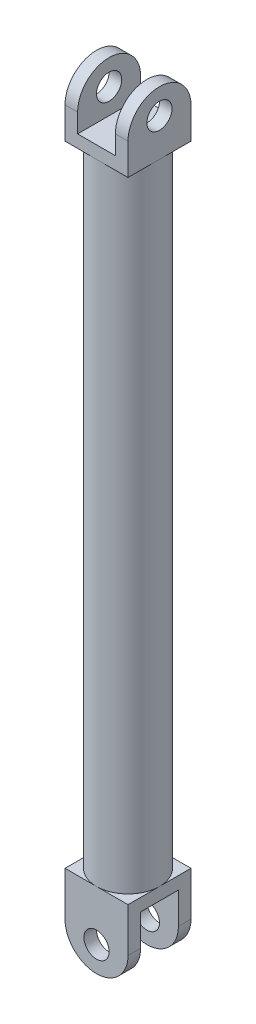
ISO-10303-21;
HEADER;
FILE_DESCRIPTION(('STEP AP214'),'2;1');
FILE_NAME('part.step','',(''),(''),'','','');
FILE_SCHEMA(('AUTOMOTIVE_DESIGN { 1 0 10303 214 1 1 1 1 }'));
ENDSEC;
DATA;
#1=APPLICATION_CONTEXT('core data for automotive mechanical design processes');
#2=APPLICATION_PROTOCOL_DEFINITION('international standard','automotive_design',2000,#1);
#3=PRODUCT_CONTEXT('',#1,'mechanical');
#4=PRODUCT('Part','Part','',(#3));
#5=PRODUCT_RELATED_PRODUCT_CATEGORY('part','',(#4));
#6=PRODUCT_DEFINITION_FORMATION('','',#4);
#7=PRODUCT_DEFINITION_CONTEXT('part definition',#1,'design');
#8=PRODUCT_DEFINITION('design','',#6,#7);
#9=PRODUCT_DEFINITION_SHAPE('','',#8);
#10=(LENGTH_UNIT() NAMED_UNIT(*) SI_UNIT(.MILLI.,.METRE.));
#11=(NAMED_UNIT(*) PLANE_ANGLE_UNIT() SI_UNIT($,.RADIAN.));
#12=(NAMED_UNIT(*) SI_UNIT($,.STERADIAN.) SOLID_ANGLE_UNIT());
#13=UNCERTAINTY_MEASURE_WITH_UNIT(LENGTH_MEASURE(1.E-05),#10,'distance_accuracy_value','');
#14=(GEOMETRIC_REPRESENTATION_CONTEXT(3) GLOBAL_UNCERTAINTY_ASSIGNED_CONTEXT((#13)) GLOBAL_UNIT_ASSIGNED_CONTEXT((#10,
#11,#12)) REPRESENTATION_CONTEXT('',''));
#15=CARTESIAN_POINT('',(0.,0.,0.));
#16=DIRECTION('',(0.,0.,1.));
#17=DIRECTION('',(1.,0.,0.));
#18=AXIS2_PLACEMENT_3D('',#15,#16,#17);
#19=CARTESIAN_POINT('',(0.,-142.5,7.5));
#20=DIRECTION('',(0.,0.,-1.));
#21=DIRECTION('',(-1.,0.,0.));
#22=AXIS2_PLACEMENT_3D('',#19,#20,#21);
#23=CYLINDRICAL_SURFACE('',#22,12.5);
#24=DIRECTION('',(0.,0.,1.));
#25=VECTOR('',#24,1.);
#26=CARTESIAN_POINT('',(-12.5,-142.5,7.5));
#27=LINE('',#26,#25);
#28=CARTESIAN_POINT('',(-12.5,-142.5,7.5));
#29=VERTEX_POINT('',#28);
#30=CARTESIAN_POINT('',(-12.5,-142.5,12.5));
#31=VERTEX_POINT('',#30);
#32=EDGE_CURVE('E374',#29,#31,#27,.T.);
#33=ORIENTED_EDGE('',*,*,#32,.F.);
#34=CARTESIAN_POINT('',(0.,-142.5,7.5));
#35=DIRECTION('',(0.,0.,1.));
#36=DIRECTION('',(1.,0.,0.));
#37=AXIS2_PLACEMENT_3D('',#34,#35,#36);
#38=CIRCLE('',#37,12.5);
#39=CARTESIAN_POINT('',(12.5,-142.5,7.5));
#40=VERTEX_POINT('',#39);
#41=EDGE_CURVE('E50',#40,#29,#38,.F.);
#42=ORIENTED_EDGE('',*,*,#41,.F.);
#43=DIRECTION('',(0.,0.,-1.));
#44=VECTOR('',#43,1.);
#45=CARTESIAN_POINT('',(12.5,-142.5,12.5));
#46=LINE('',#45,#44);
#47=CARTESIAN_POINT('',(12.5,-142.5,12.5));
#48=VERTEX_POINT('',#47);
#49=EDGE_CURVE('E377',#48,#40,#46,.T.);
#50=ORIENTED_EDGE('',*,*,#49,.F.);
#51=CARTESIAN_POINT('',(0.,-142.5,12.5));
#52=DIRECTION('',(0.,0.,1.));
#53=DIRECTION('',(1.,0.,0.));
#54=AXIS2_PLACEMENT_3D('',#51,#52,#53);
#55=CIRCLE('',#54,12.5);
#56=EDGE_CURVE('E11',#31,#48,#55,.T.);
#57=ORIENTED_EDGE('',*,*,#56,.F.);
#58=EDGE_LOOP('',(#33,#42,#50,#57));
#59=FACE_BOUND('',#58,.T.);
#60=ADVANCED_FACE('F41',(#59),#23,.T.);
#61=CARTESIAN_POINT('',(0.,-142.5,-12.5));
#62=DIRECTION('',(0.,0.,-1.));
#63=DIRECTION('',(-1.,0.,0.));
#64=AXIS2_PLACEMENT_3D('',#61,#62,#63);
#65=CYLINDRICAL_SURFACE('',#64,12.5);
#66=DIRECTION('',(0.,0.,1.));
#67=VECTOR('',#66,1.);
#68=CARTESIAN_POINT('',(-12.5,-142.5,-12.5));
#69=LINE('',#68,#67);
#70=CARTESIAN_POINT('',(-12.5,-142.5,-12.5));
#71=VERTEX_POINT('',#70);
#72=CARTESIAN_POINT('',(-12.5,-142.5,-7.5));
#73=VERTEX_POINT('',#72);
#74=EDGE_CURVE('E356',#71,#73,#69,.T.);
#75=ORIENTED_EDGE('',*,*,#74,.F.);
#76=CARTESIAN_POINT('',(0.,-142.5,-12.5));
#77=DIRECTION('',(0.,0.,1.));
#78=DIRECTION('',(1.,0.,0.));
#79=AXIS2_PLACEMENT_3D('',#76,#77,#78);
#80=CIRCLE('',#79,12.5);
#81=CARTESIAN_POINT('',(12.5,-142.5,-12.5));
#82=VERTEX_POINT('',#81);
#83=EDGE_CURVE('E368',#82,#71,#80,.F.);
#84=ORIENTED_EDGE('',*,*,#83,.F.);
#85=DIRECTION('',(0.,0.,-1.));
#86=VECTOR('',#85,1.);
#87=CARTESIAN_POINT('',(12.5,-142.5,12.5));
#88=LINE('',#87,#86);
#89=CARTESIAN_POINT('',(12.5,-142.5,-7.5));
#90=VERTEX_POINT('',#89);
#91=EDGE_CURVE('E364',#90,#82,#88,.T.);
#92=ORIENTED_EDGE('',*,*,#91,.F.);
#93=CARTESIAN_POINT('',(0.,-142.5,-7.5));
#94=DIRECTION('',(0.,0.,-1.));
#95=DIRECTION('',(-1.,0.,0.));
#96=AXIS2_PLACEMENT_3D('',#93,#94,#95);
#97=CIRCLE('',#96,12.5);
#98=EDGE_CURVE('E371',#73,#90,#97,.F.);
#99=ORIENTED_EDGE('',*,*,#98,.F.);
#100=EDGE_LOOP('',(#75,#84,#92,#99));
#101=FACE_BOUND('',#100,.T.);
#102=ADVANCED_FACE('F466',(#101),#65,.T.);
#103=CARTESIAN_POINT('',(0.,-130.,0.));
#104=DIRECTION('',(0.,1.,0.));
#105=DIRECTION('',(0.,0.,1.));
#106=AXIS2_PLACEMENT_3D('',#103,#104,#105);
#107=PLANE('',#106);
#108=DIRECTION('',(1.,0.,0.));
#109=VECTOR('',#108,1.);
#110=CARTESIAN_POINT('',(-12.5,-130.,7.5));
#111=LINE('',#110,#109);
#112=CARTESIAN_POINT('',(-12.5,-130.,7.5));
#113=VERTEX_POINT('',#112);
#114=CARTESIAN_POINT('',(12.5,-130.,7.5));
#115=VERTEX_POINT('',#114);
#116=EDGE_CURVE('E180',#113,#115,#111,.T.);
#117=ORIENTED_EDGE('',*,*,#116,.F.);
#118=DIRECTION('',(0.,0.,-1.));
#119=VECTOR('',#118,1.);
#120=CARTESIAN_POINT('',(-12.5,-130.,12.5));
#121=LINE('',#120,#119);
#122=CARTESIAN_POINT('',(-12.5,-130.,-7.5));
#123=VERTEX_POINT('',#122);
#124=EDGE_CURVE('E193',#113,#123,#121,.T.);
#125=ORIENTED_EDGE('',*,*,#124,.T.);
#126=DIRECTION('',(-1.,0.,0.));
#127=VECTOR('',#126,1.);
#128=CARTESIAN_POINT('',(-12.5,-130.,-7.5));
#129=LINE('',#128,#127);
#130=CARTESIAN_POINT('',(12.5,-130.,-7.49999999999999));
#131=VERTEX_POINT('',#130);
#132=EDGE_CURVE('E186',#131,#123,#129,.T.);
#133=ORIENTED_EDGE('',*,*,#132,.F.);
#134=DIRECTION('',(0.,0.,-1.));
#135=VECTOR('',#134,1.);
#136=CARTESIAN_POINT('',(12.5,-130.,12.5));
#137=LINE('',#136,#135);
#138=EDGE_CURVE('E196',#115,#131,#137,.T.);
#139=ORIENTED_EDGE('',*,*,#138,.F.);
#140=EDGE_LOOP('',(#117,#125,#133,#139));
#141=FACE_BOUND('',#140,.T.);
#142=ADVANCED_FACE('F191',(#141),#107,.F.);
#143=CARTESIAN_POINT('',(12.5,137.5,0.));
#144=DIRECTION('',(1.,0.,0.));
#145=DIRECTION('',(0.,0.,-1.));
#146=AXIS2_PLACEMENT_3D('',#143,#144,#145);
#147=CYLINDRICAL_SURFACE('',#146,12.5);
#148=DIRECTION('',(-1.,0.,0.));
#149=VECTOR('',#148,1.);
#150=CARTESIAN_POINT('',(12.5,137.5,12.5));
#151=LINE('',#150,#149);
#152=CARTESIAN_POINT('',(12.5,137.5,12.5));
#153=VERTEX_POINT('',#152);
#154=CARTESIAN_POINT('',(7.50000000000001,137.5,12.5));
#155=VERTEX_POINT('',#154);
#156=EDGE_CURVE('E342',#153,#155,#151,.T.);
#157=ORIENTED_EDGE('',*,*,#156,.F.);
#158=CARTESIAN_POINT('',(12.5,137.5,0.));
#159=DIRECTION('',(-1.,0.,0.));
#160=DIRECTION('',(0.,0.,1.));
#161=AXIS2_PLACEMENT_3D('',#158,#159,#160);
#162=CIRCLE('',#161,12.5);
#163=CARTESIAN_POINT('',(12.5,137.5,-12.5));
#164=VERTEX_POINT('',#163);
#165=EDGE_CURVE('E350',#164,#153,#162,.F.);
#166=ORIENTED_EDGE('',*,*,#165,.F.);
#167=DIRECTION('',(-1.,0.,0.));
#168=VECTOR('',#167,1.);
#169=CARTESIAN_POINT('',(12.5,137.5,-12.5));
#170=LINE('',#169,#168);
#171=CARTESIAN_POINT('',(7.50000000000001,137.5,-12.5));
#172=VERTEX_POINT('',#171);
#173=EDGE_CURVE('E346',#172,#164,#170,.F.);
#174=ORIENTED_EDGE('',*,*,#173,.F.);
#175=CARTESIAN_POINT('',(7.50000000000001,137.5,0.));
#176=DIRECTION('',(1.,0.,0.));
#177=DIRECTION('',(0.,0.,-1.));
#178=AXIS2_PLACEMENT_3D('',#175,#176,#177);
#179=CIRCLE('',#178,12.5);
#180=EDGE_CURVE('E353',#155,#172,#179,.F.);
#181=ORIENTED_EDGE('',*,*,#180,.F.);
#182=EDGE_LOOP('',(#157,#166,#174,#181));
#183=FACE_BOUND('',#182,.T.);
#184=ADVANCED_FACE('F446',(#183),#147,.T.);
#185=CARTESIAN_POINT('',(-7.5,137.5,0.));
#186=DIRECTION('',(1.,0.,0.));
#187=DIRECTION('',(0.,0.,-1.));
#188=AXIS2_PLACEMENT_3D('',#185,#186,#187);
#189=CYLINDRICAL_SURFACE('',#188,12.5);
#190=DIRECTION('',(-1.,0.,0.));
#191=VECTOR('',#190,1.);
#192=CARTESIAN_POINT('',(-7.5,137.5,12.5));
#193=LINE('',#192,#191);
#194=CARTESIAN_POINT('',(-7.5,137.5,12.5));
#195=VERTEX_POINT('',#194);
#196=CARTESIAN_POINT('',(-12.5,137.5,12.5));
#197=VERTEX_POINT('',#196);
#198=EDGE_CURVE('E325',#195,#197,#193,.T.);
#199=ORIENTED_EDGE('',*,*,#198,.F.);
#200=CARTESIAN_POINT('',(-7.5,137.5,0.));
#201=DIRECTION('',(-1.,0.,0.));
#202=DIRECTION('',(0.,0.,1.));
#203=AXIS2_PLACEMENT_3D('',#200,#201,#202);
#204=CIRCLE('',#203,12.5);
#205=CARTESIAN_POINT('',(-7.5,137.5,-12.5));
#206=VERTEX_POINT('',#205);
#207=EDGE_CURVE('E336',#206,#195,#204,.F.);
#208=ORIENTED_EDGE('',*,*,#207,.F.);
#209=DIRECTION('',(-1.,0.,0.));
#210=VECTOR('',#209,1.);
#211=CARTESIAN_POINT('',(-7.5,137.5,-12.5));
#212=LINE('',#211,#210);
#213=CARTESIAN_POINT('',(-12.5,137.5,-12.5));
#214=VERTEX_POINT('',#213);
#215=EDGE_CURVE('E332',#214,#206,#212,.F.);
#216=ORIENTED_EDGE('',*,*,#215,.F.);
#217=CARTESIAN_POINT('',(-12.5,137.5,0.));
#218=DIRECTION('',(1.,0.,0.));
#219=DIRECTION('',(0.,0.,-1.));
#220=AXIS2_PLACEMENT_3D('',#217,#218,#219);
#221=CIRCLE('',#220,12.5);
#222=EDGE_CURVE('E339',#197,#214,#221,.F.);
#223=ORIENTED_EDGE('',*,*,#222,.F.);
#224=EDGE_LOOP('',(#199,#208,#216,#223));
#225=FACE_BOUND('',#224,.T.);
#226=ADVANCED_FACE('F563',(#225),#189,.T.);
#227=CARTESIAN_POINT('',(0.,130.,0.));
#228=DIRECTION('',(0.,1.,0.));
#229=DIRECTION('',(0.,0.,1.));
#230=AXIS2_PLACEMENT_3D('',#227,#228,#229);
#231=PLANE('',#230);
#232=DIRECTION('',(1.,0.,0.));
#233=VECTOR('',#232,1.);
#234=CARTESIAN_POINT('',(-12.5,130.,12.5));
#235=LINE('',#234,#233);
#236=CARTESIAN_POINT('',(-7.5,130.,12.5));
#237=VERTEX_POINT('',#236);
#238=CARTESIAN_POINT('',(7.50000000000001,130.,12.5));
#239=VERTEX_POINT('',#238);
#240=EDGE_CURVE('E275',#237,#239,#235,.T.);
#241=ORIENTED_EDGE('',*,*,#240,.T.);
#242=DIRECTION('',(0.,0.,-1.));
#243=VECTOR('',#242,1.);
#244=CARTESIAN_POINT('',(7.50000000000001,130.,0.));
#245=LINE('',#244,#243);
#246=CARTESIAN_POINT('',(7.50000000000001,130.,-12.5));
#247=VERTEX_POINT('',#246);
#248=EDGE_CURVE('E260',#239,#247,#245,.T.);
#249=ORIENTED_EDGE('',*,*,#248,.T.);
#250=DIRECTION('',(-1.,0.,0.));
#251=VECTOR('',#250,1.);
#252=CARTESIAN_POINT('',(-12.5,130.,-12.5));
#253=LINE('',#252,#251);
#254=CARTESIAN_POINT('',(-7.5,130.,-12.5));
#255=VERTEX_POINT('',#254);
#256=EDGE_CURVE('E271',#247,#255,#253,.T.);
#257=ORIENTED_EDGE('',*,*,#256,.T.);
#258=DIRECTION('',(0.,0.,1.));
#259=VECTOR('',#258,1.);
#260=CARTESIAN_POINT('',(-7.5,130.,0.));
#261=LINE('',#260,#259);
#262=EDGE_CURVE('E314',#255,#237,#261,.T.);
#263=ORIENTED_EDGE('',*,*,#262,.T.);
#264=EDGE_LOOP('',(#241,#249,#257,#263));
#265=FACE_BOUND('',#264,.T.);
#266=ADVANCED_FACE('F438',(#265),#231,.T.);
#267=CARTESIAN_POINT('',(0.,125.,0.));
#268=DIRECTION('',(0.,-1.,0.));
#269=DIRECTION('',(0.,0.,-1.));
#270=AXIS2_PLACEMENT_3D('',#267,#268,#269);
#271=CYLINDRICAL_SURFACE('',#270,12.5);
#272=CARTESIAN_POINT('',(0.,125.,0.));
#273=DIRECTION('',(0.,1.,0.));
#274=DIRECTION('',(0.,0.,1.));
#275=AXIS2_PLACEMENT_3D('',#272,#273,#274);
#276=CIRCLE('',#275,12.5);
#277=CARTESIAN_POINT('',(0.,125.,12.5));
#278=VERTEX_POINT('',#277);
#279=CARTESIAN_POINT('',(12.5,125.,0.));
#280=VERTEX_POINT('',#279);
#281=EDGE_CURVE('E311',#278,#280,#276,.T.);
#282=ORIENTED_EDGE('',*,*,#281,.F.);
#283=CARTESIAN_POINT('',(-12.5,125.,0.));
#284=VERTEX_POINT('',#283);
#285=EDGE_CURVE('E316',#284,#278,#276,.T.);
#286=ORIENTED_EDGE('',*,*,#285,.F.);
#287=CARTESIAN_POINT('',(0.,125.,-12.5));
#288=VERTEX_POINT('',#287);
#289=EDGE_CURVE('E382',#288,#284,#276,.T.);
#290=ORIENTED_EDGE('',*,*,#289,.F.);
#291=EDGE_CURVE('E315',#280,#288,#276,.T.);
#292=ORIENTED_EDGE('',*,*,#291,.F.);
#293=EDGE_LOOP('',(#282,#286,#290,#292));
#294=FACE_BOUND('',#293,.T.);
#295=CARTESIAN_POINT('',(0.,-125.,0.));
#296=DIRECTION('',(0.,1.,0.));
#297=DIRECTION('',(0.,0.,1.));
#298=AXIS2_PLACEMENT_3D('',#295,#296,#297);
#299=CIRCLE('',#298,12.5);
#300=CARTESIAN_POINT('',(0.,-125.,12.5));
#301=VERTEX_POINT('',#300);
#302=CARTESIAN_POINT('',(12.5,-125.,0.));
#303=VERTEX_POINT('',#302);
#304=EDGE_CURVE('E317',#301,#303,#299,.T.);
#305=ORIENTED_EDGE('',*,*,#304,.T.);
#306=CARTESIAN_POINT('',(0.,-125.,-12.5));
#307=VERTEX_POINT('',#306);
#308=EDGE_CURVE('E321',#303,#307,#299,.T.);
#309=ORIENTED_EDGE('',*,*,#308,.T.);
#310=CARTESIAN_POINT('',(-12.5,-125.,0.));
#311=VERTEX_POINT('',#310);
#312=EDGE_CURVE('E387',#307,#311,#299,.T.);
#313=ORIENTED_EDGE('',*,*,#312,.T.);
#314=EDGE_CURVE('E310',#311,#301,#299,.T.);
#315=ORIENTED_EDGE('',*,*,#314,.T.);
#316=EDGE_LOOP('',(#305,#309,#313,#315));
#317=FACE_BOUND('',#316,.T.);
#318=ADVANCED_FACE('F418',(#294,#317),#271,.T.);
#319=CARTESIAN_POINT('',(0.,125.,0.));
#320=DIRECTION('',(0.,1.,0.));
#321=DIRECTION('',(0.,0.,1.));
#322=AXIS2_PLACEMENT_3D('',#319,#320,#321);
#323=PLANE('',#322);
#324=DIRECTION('',(0.,0.,-1.));
#325=VECTOR('',#324,1.);
#326=CARTESIAN_POINT('',(12.5,125.,-12.5));
#327=LINE('',#326,#325);
#328=CARTESIAN_POINT('',(12.5,125.,12.5));
#329=VERTEX_POINT('',#328);
#330=EDGE_CURVE('E281',#329,#280,#327,.T.);
#331=ORIENTED_EDGE('',*,*,#330,.F.);
#332=DIRECTION('',(1.,0.,0.));
#333=VECTOR('',#332,1.);
#334=CARTESIAN_POINT('',(-12.5,125.,12.5));
#335=LINE('',#334,#333);
#336=EDGE_CURVE('E295',#278,#329,#335,.T.);
#337=ORIENTED_EDGE('',*,*,#336,.F.);
#338=ORIENTED_EDGE('',*,*,#281,.T.);
#339=EDGE_LOOP('',(#331,#337,#338));
#340=FACE_BOUND('',#339,.T.);
#341=ADVANCED_FACE('F452',(#340),#323,.F.);
#342=ORIENTED_EDGE('',*,*,#291,.T.);
#343=DIRECTION('',(-1.,0.,0.));
#344=VECTOR('',#343,1.);
#345=CARTESIAN_POINT('',(-12.5,125.,-12.5));
#346=LINE('',#345,#344);
#347=CARTESIAN_POINT('',(12.5,125.,-12.5));
#348=VERTEX_POINT('',#347);
#349=EDGE_CURVE('E286',#348,#288,#346,.T.);
#350=ORIENTED_EDGE('',*,*,#349,.F.);
#351=EDGE_CURVE('E270',#280,#348,#327,.T.);
#352=ORIENTED_EDGE('',*,*,#351,.F.);
#353=EDGE_LOOP('',(#342,#350,#352));
#354=FACE_BOUND('',#353,.T.);
#355=ADVANCED_FACE('F406',(#354),#323,.F.);
#356=DIRECTION('',(0.,0.,1.));
#357=VECTOR('',#356,1.);
#358=CARTESIAN_POINT('',(-12.5,125.,-12.5));
#359=LINE('',#358,#357);
#360=CARTESIAN_POINT('',(-12.5,125.,-12.5));
#361=VERTEX_POINT('',#360);
#362=EDGE_CURVE('E291',#361,#284,#359,.T.);
#363=ORIENTED_EDGE('',*,*,#362,.F.);
#364=EDGE_CURVE('E285',#288,#361,#346,.T.);
#365=ORIENTED_EDGE('',*,*,#364,.F.);
#366=ORIENTED_EDGE('',*,*,#289,.T.);
#367=EDGE_LOOP('',(#363,#365,#366));
#368=FACE_BOUND('',#367,.T.);
#369=ADVANCED_FACE('F422',(#368),#323,.F.);
#370=ORIENTED_EDGE('',*,*,#285,.T.);
#371=CARTESIAN_POINT('',(-12.5,125.,12.5));
#372=VERTEX_POINT('',#371);
#373=EDGE_CURVE('E276',#372,#278,#335,.T.);
#374=ORIENTED_EDGE('',*,*,#373,.F.);
#375=EDGE_CURVE('E290',#284,#372,#359,.T.);
#376=ORIENTED_EDGE('',*,*,#375,.F.);
#377=EDGE_LOOP('',(#370,#374,#376));
#378=FACE_BOUND('',#377,.T.);
#379=ADVANCED_FACE('F455',(#378),#323,.F.);
#380=CARTESIAN_POINT('',(12.5,130.,-12.5));
#381=DIRECTION('',(-1.,0.,0.));
#382=DIRECTION('',(0.,0.,1.));
#383=AXIS2_PLACEMENT_3D('',#380,#381,#382);
#384=PLANE('',#383);
#385=CARTESIAN_POINT('',(12.5,140.,0.));
#386=DIRECTION('',(-1.,0.,0.));
#387=DIRECTION('',(0.,0.,1.));
#388=AXIS2_PLACEMENT_3D('',#385,#386,#387);
#389=CIRCLE('',#388,5.00000000000001);
#390=CARTESIAN_POINT('',(12.5,140.,5.));
#391=VERTEX_POINT('',#390);
#392=EDGE_CURVE('E236',#391,#391,#389,.T.);
#393=ORIENTED_EDGE('',*,*,#392,.T.);
#394=EDGE_LOOP('',(#393));
#395=FACE_BOUND('',#394,.T.);
#396=DIRECTION('',(0.,-1.,0.));
#397=VECTOR('',#396,1.);
#398=CARTESIAN_POINT('',(12.5,130.,-12.5));
#399=LINE('',#398,#397);
#400=EDGE_CURVE('E307',#164,#348,#399,.T.);
#401=ORIENTED_EDGE('',*,*,#400,.F.);
#402=ORIENTED_EDGE('',*,*,#165,.T.);
#403=DIRECTION('',(0.,-1.,0.));
#404=VECTOR('',#403,1.);
#405=CARTESIAN_POINT('',(12.5,130.,12.5));
#406=LINE('',#405,#404);
#407=EDGE_CURVE('E280',#153,#329,#406,.T.);
#408=ORIENTED_EDGE('',*,*,#407,.T.);
#409=ORIENTED_EDGE('',*,*,#330,.T.);
#410=ORIENTED_EDGE('',*,*,#351,.T.);
#411=EDGE_LOOP('',(#401,#402,#408,#409,#410));
#412=FACE_BOUND('',#411,.T.);
#413=ADVANCED_FACE('F403',(#395,#412),#384,.F.);
#414=CARTESIAN_POINT('',(-12.5,130.,-12.5));
#415=DIRECTION('',(0.,0.,1.));
#416=DIRECTION('',(1.,0.,0.));
#417=AXIS2_PLACEMENT_3D('',#414,#415,#416);
#418=PLANE('',#417);
#419=DIRECTION('',(0.,-1.,0.));
#420=VECTOR('',#419,1.);
#421=CARTESIAN_POINT('',(7.50000000000001,150.,-12.5));
#422=LINE('',#421,#420);
#423=EDGE_CURVE('E257',#172,#247,#422,.T.);
#424=ORIENTED_EDGE('',*,*,#423,.F.);
#425=ORIENTED_EDGE('',*,*,#173,.T.);
#426=ORIENTED_EDGE('',*,*,#400,.T.);
#427=ORIENTED_EDGE('',*,*,#349,.T.);
#428=ORIENTED_EDGE('',*,*,#364,.T.);
#429=DIRECTION('',(0.,-1.,0.));
#430=VECTOR('',#429,1.);
#431=CARTESIAN_POINT('',(-12.5,130.,-12.5));
#432=LINE('',#431,#430);
#433=EDGE_CURVE('E304',#214,#361,#432,.T.);
#434=ORIENTED_EDGE('',*,*,#433,.F.);
#435=ORIENTED_EDGE('',*,*,#215,.T.);
#436=DIRECTION('',(0.,-1.,0.));
#437=VECTOR('',#436,1.);
#438=CARTESIAN_POINT('',(-7.5,150.,-12.5));
#439=LINE('',#438,#437);
#440=EDGE_CURVE('E267',#206,#255,#439,.T.);
#441=ORIENTED_EDGE('',*,*,#440,.T.);
#442=ORIENTED_EDGE('',*,*,#256,.F.);
#443=EDGE_LOOP('',(#424,#425,#426,#427,#428,#434,#435,#441,#442));
#444=FACE_BOUND('',#443,.T.);
#445=ADVANCED_FACE('F411',(#444),#418,.F.);
#446=CARTESIAN_POINT('',(-12.5,130.,-12.5));
#447=DIRECTION('',(1.,0.,0.));
#448=DIRECTION('',(0.,0.,-1.));
#449=AXIS2_PLACEMENT_3D('',#446,#447,#448);
#450=PLANE('',#449);
#451=CARTESIAN_POINT('',(-12.5,140.,0.));
#452=DIRECTION('',(1.,0.,0.));
#453=DIRECTION('',(0.,0.,-1.));
#454=AXIS2_PLACEMENT_3D('',#451,#452,#453);
#455=CIRCLE('',#454,5.00000000000001);
#456=CARTESIAN_POINT('',(-12.5,140.,-5.));
#457=VERTEX_POINT('',#456);
#458=EDGE_CURVE('E250',#457,#457,#455,.T.);
#459=ORIENTED_EDGE('',*,*,#458,.T.);
#460=EDGE_LOOP('',(#459));
#461=FACE_BOUND('',#460,.T.);
#462=DIRECTION('',(0.,-1.,0.));
#463=VECTOR('',#462,1.);
#464=CARTESIAN_POINT('',(-12.5,130.,12.5));
#465=LINE('',#464,#463);
#466=EDGE_CURVE('E301',#197,#372,#465,.T.);
#467=ORIENTED_EDGE('',*,*,#466,.F.);
#468=ORIENTED_EDGE('',*,*,#222,.T.);
#469=ORIENTED_EDGE('',*,*,#433,.T.);
#470=ORIENTED_EDGE('',*,*,#362,.T.);
#471=ORIENTED_EDGE('',*,*,#375,.T.);
#472=EDGE_LOOP('',(#467,#468,#469,#470,#471));
#473=FACE_BOUND('',#472,.T.);
#474=ADVANCED_FACE('F425',(#461,#473),#450,.F.);
#475=CARTESIAN_POINT('',(-12.5,130.,12.5));
#476=DIRECTION('',(0.,0.,-1.));
#477=DIRECTION('',(-1.,0.,0.));
#478=AXIS2_PLACEMENT_3D('',#475,#476,#477);
#479=PLANE('',#478);
#480=ORIENTED_EDGE('',*,*,#407,.F.);
#481=ORIENTED_EDGE('',*,*,#156,.T.);
#482=DIRECTION('',(0.,-1.,0.));
#483=VECTOR('',#482,1.);
#484=CARTESIAN_POINT('',(7.50000000000001,150.,12.5));
#485=LINE('',#484,#483);
#486=EDGE_CURVE('E254',#155,#239,#485,.T.);
#487=ORIENTED_EDGE('',*,*,#486,.T.);
#488=ORIENTED_EDGE('',*,*,#240,.F.);
#489=DIRECTION('',(0.,-1.,0.));
#490=VECTOR('',#489,1.);
#491=CARTESIAN_POINT('',(-7.5,150.,12.5));
#492=LINE('',#491,#490);
#493=EDGE_CURVE('E264',#195,#237,#492,.T.);
#494=ORIENTED_EDGE('',*,*,#493,.F.);
#495=ORIENTED_EDGE('',*,*,#198,.T.);
#496=ORIENTED_EDGE('',*,*,#466,.T.);
#497=ORIENTED_EDGE('',*,*,#373,.T.);
#498=ORIENTED_EDGE('',*,*,#336,.T.);
#499=EDGE_LOOP('',(#480,#481,#487,#488,#494,#495,#496,#497,#498));
#500=FACE_BOUND('',#499,.T.);
#501=ADVANCED_FACE('F450',(#500),#479,.F.);
#502=CARTESIAN_POINT('',(-7.5,150.,-12.5));
#503=DIRECTION('',(-1.,0.,0.));
#504=DIRECTION('',(0.,0.,1.));
#505=AXIS2_PLACEMENT_3D('',#502,#503,#504);
#506=PLANE('',#505);
#507=CARTESIAN_POINT('',(-7.5,140.,0.));
#508=DIRECTION('',(-1.,0.,0.));
#509=DIRECTION('',(0.,0.,1.));
#510=AXIS2_PLACEMENT_3D('',#507,#508,#509);
#511=CIRCLE('',#510,5.00000000000001);
#512=CARTESIAN_POINT('',(-7.5,140.,5.00000000000001));
#513=VERTEX_POINT('',#512);
#514=EDGE_CURVE('E246',#513,#513,#511,.T.);
#515=ORIENTED_EDGE('',*,*,#514,.T.);
#516=EDGE_LOOP('',(#515));
#517=FACE_BOUND('',#516,.T.);
#518=ORIENTED_EDGE('',*,*,#440,.F.);
#519=ORIENTED_EDGE('',*,*,#207,.T.);
#520=ORIENTED_EDGE('',*,*,#493,.T.);
#521=ORIENTED_EDGE('',*,*,#262,.F.);
#522=EDGE_LOOP('',(#518,#519,#520,#521));
#523=FACE_BOUND('',#522,.T.);
#524=ADVANCED_FACE('F433',(#517,#523),#506,.F.);
#525=CARTESIAN_POINT('',(7.50000000000001,150.,-12.5));
#526=DIRECTION('',(1.,0.,0.));
#527=DIRECTION('',(0.,0.,-1.));
#528=AXIS2_PLACEMENT_3D('',#525,#526,#527);
#529=PLANE('',#528);
#530=CARTESIAN_POINT('',(7.50000000000001,140.,0.));
#531=DIRECTION('',(1.,0.,0.));
#532=DIRECTION('',(0.,0.,-1.));
#533=AXIS2_PLACEMENT_3D('',#530,#531,#532);
#534=CIRCLE('',#533,5.00000000000001);
#535=CARTESIAN_POINT('',(7.50000000000001,140.,-5.00000000000001));
#536=VERTEX_POINT('',#535);
#537=EDGE_CURVE('E245',#536,#536,#534,.T.);
#538=ORIENTED_EDGE('',*,*,#537,.T.);
#539=EDGE_LOOP('',(#538));
#540=FACE_BOUND('',#539,.T.);
#541=ORIENTED_EDGE('',*,*,#486,.F.);
#542=ORIENTED_EDGE('',*,*,#180,.T.);
#543=ORIENTED_EDGE('',*,*,#423,.T.);
#544=ORIENTED_EDGE('',*,*,#248,.F.);
#545=EDGE_LOOP('',(#541,#542,#543,#544));
#546=FACE_BOUND('',#545,.T.);
#547=ADVANCED_FACE('F443',(#540,#546),#529,.F.);
#548=CARTESIAN_POINT('',(12.5,140.,0.));
#549=DIRECTION('',(-1.,0.,0.));
#550=DIRECTION('',(0.,0.,1.));
#551=AXIS2_PLACEMENT_3D('',#548,#549,#550);
#552=CYLINDRICAL_SURFACE('',#551,5.00000000000001);
#553=ORIENTED_EDGE('',*,*,#392,.F.);
#554=EDGE_LOOP('',(#553));
#555=FACE_BOUND('',#554,.T.);
#556=ORIENTED_EDGE('',*,*,#537,.F.);
#557=EDGE_LOOP('',(#556));
#558=FACE_BOUND('',#557,.T.);
#559=ADVANCED_FACE('F555',(#555,#558),#552,.F.);
#560=ORIENTED_EDGE('',*,*,#514,.F.);
#561=EDGE_LOOP('',(#560));
#562=FACE_BOUND('',#561,.T.);
#563=ORIENTED_EDGE('',*,*,#458,.F.);
#564=EDGE_LOOP('',(#563));
#565=FACE_BOUND('',#564,.T.);
#566=ADVANCED_FACE('F541',(#562,#565),#552,.F.);
#567=CARTESIAN_POINT('',(0.,-125.,0.));
#568=DIRECTION('',(0.,1.,0.));
#569=DIRECTION('',(0.,0.,1.));
#570=AXIS2_PLACEMENT_3D('',#567,#568,#569);
#571=PLANE('',#570);
#572=ORIENTED_EDGE('',*,*,#304,.F.);
#573=DIRECTION('',(1.,0.,0.));
#574=VECTOR('',#573,1.);
#575=CARTESIAN_POINT('',(-12.5,-125.,12.5));
#576=LINE('',#575,#574);
#577=CARTESIAN_POINT('',(12.5,-125.,12.5));
#578=VERTEX_POINT('',#577);
#579=EDGE_CURVE('E219',#301,#578,#576,.T.);
#580=ORIENTED_EDGE('',*,*,#579,.T.);
#581=DIRECTION('',(0.,0.,-1.));
#582=VECTOR('',#581,1.);
#583=CARTESIAN_POINT('',(12.5,-125.,12.5));
#584=LINE('',#583,#582);
#585=EDGE_CURVE('E220',#578,#303,#584,.T.);
#586=ORIENTED_EDGE('',*,*,#585,.T.);
#587=EDGE_LOOP('',(#572,#580,#586));
#588=FACE_BOUND('',#587,.T.);
#589=ADVANCED_FACE('F538',(#588),#571,.T.);
#590=ORIENTED_EDGE('',*,*,#308,.F.);
#591=CARTESIAN_POINT('',(12.5,-125.,-12.5));
#592=VERTEX_POINT('',#591);
#593=EDGE_CURVE('E218',#303,#592,#584,.T.);
#594=ORIENTED_EDGE('',*,*,#593,.T.);
#595=DIRECTION('',(1.,0.,0.));
#596=VECTOR('',#595,1.);
#597=CARTESIAN_POINT('',(-12.5,-125.,-12.5));
#598=LINE('',#597,#596);
#599=EDGE_CURVE('E224',#307,#592,#598,.T.);
#600=ORIENTED_EDGE('',*,*,#599,.F.);
#601=EDGE_LOOP('',(#590,#594,#600));
#602=FACE_BOUND('',#601,.T.);
#603=ADVANCED_FACE('F489',(#602),#571,.T.);
#604=ORIENTED_EDGE('',*,*,#312,.F.);
#605=CARTESIAN_POINT('',(-12.5,-125.,-12.5));
#606=VERTEX_POINT('',#605);
#607=EDGE_CURVE('E225',#606,#307,#598,.T.);
#608=ORIENTED_EDGE('',*,*,#607,.F.);
#609=DIRECTION('',(0.,0.,-1.));
#610=VECTOR('',#609,1.);
#611=CARTESIAN_POINT('',(-12.5,-125.,12.5));
#612=LINE('',#611,#610);
#613=EDGE_CURVE('E229',#311,#606,#612,.T.);
#614=ORIENTED_EDGE('',*,*,#613,.F.);
#615=EDGE_LOOP('',(#604,#608,#614));
#616=FACE_BOUND('',#615,.T.);
#617=ADVANCED_FACE('F485',(#616),#571,.T.);
#618=ORIENTED_EDGE('',*,*,#314,.F.);
#619=CARTESIAN_POINT('',(-12.5,-125.,12.5));
#620=VERTEX_POINT('',#619);
#621=EDGE_CURVE('E211',#620,#311,#612,.T.);
#622=ORIENTED_EDGE('',*,*,#621,.F.);
#623=EDGE_CURVE('E215',#620,#301,#576,.T.);
#624=ORIENTED_EDGE('',*,*,#623,.T.);
#625=EDGE_LOOP('',(#618,#622,#624));
#626=FACE_BOUND('',#625,.T.);
#627=ADVANCED_FACE('F478',(#626),#571,.T.);
#628=CARTESIAN_POINT('',(-12.5,-130.,12.5));
#629=DIRECTION('',(0.,0.,1.));
#630=DIRECTION('',(1.,0.,0.));
#631=AXIS2_PLACEMENT_3D('',#628,#629,#630);
#632=PLANE('',#631);
#633=CARTESIAN_POINT('',(0.,-145.,12.5));
#634=DIRECTION('',(0.,0.,-1.));
#635=DIRECTION('',(-1.,0.,0.));
#636=AXIS2_PLACEMENT_3D('',#633,#634,#635);
#637=CIRCLE('',#636,5.00000000000001);
#638=CARTESIAN_POINT('',(-5.00000000000001,-145.,12.5));
#639=VERTEX_POINT('',#638);
#640=EDGE_CURVE('E361',#639,#639,#637,.T.);
#641=ORIENTED_EDGE('',*,*,#640,.T.);
#642=EDGE_LOOP('',(#641));
#643=FACE_BOUND('',#642,.T.);
#644=DIRECTION('',(0.,1.,0.));
#645=VECTOR('',#644,1.);
#646=CARTESIAN_POINT('',(-12.5,-130.,12.5));
#647=LINE('',#646,#645);
#648=EDGE_CURVE('E233',#31,#620,#647,.T.);
#649=ORIENTED_EDGE('',*,*,#648,.F.);
#650=ORIENTED_EDGE('',*,*,#56,.T.);
#651=DIRECTION('',(0.,1.,0.));
#652=VECTOR('',#651,1.);
#653=CARTESIAN_POINT('',(12.5,-130.,12.5));
#654=LINE('',#653,#652);
#655=EDGE_CURVE('E205',#48,#578,#654,.T.);
#656=ORIENTED_EDGE('',*,*,#655,.T.);
#657=ORIENTED_EDGE('',*,*,#579,.F.);
#658=ORIENTED_EDGE('',*,*,#623,.F.);
#659=EDGE_LOOP('',(#649,#650,#656,#657,#658));
#660=FACE_BOUND('',#659,.T.);
#661=ADVANCED_FACE('F473',(#643,#660),#632,.T.);
#662=CARTESIAN_POINT('',(-12.5,-130.,12.5));
#663=DIRECTION('',(1.,0.,0.));
#664=DIRECTION('',(0.,0.,-1.));
#665=AXIS2_PLACEMENT_3D('',#662,#663,#664);
#666=PLANE('',#665);
#667=DIRECTION('',(0.,1.,0.));
#668=VECTOR('',#667,1.);
#669=CARTESIAN_POINT('',(-12.5,-155.,7.5));
#670=LINE('',#669,#668);
#671=EDGE_CURVE('E176',#29,#113,#670,.T.);
#672=ORIENTED_EDGE('',*,*,#671,.F.);
#673=ORIENTED_EDGE('',*,*,#32,.T.);
#674=ORIENTED_EDGE('',*,*,#648,.T.);
#675=ORIENTED_EDGE('',*,*,#621,.T.);
#676=ORIENTED_EDGE('',*,*,#613,.T.);
#677=DIRECTION('',(0.,1.,0.));
#678=VECTOR('',#677,1.);
#679=CARTESIAN_POINT('',(-12.5,-130.,-12.5));
#680=LINE('',#679,#678);
#681=EDGE_CURVE('E237',#71,#606,#680,.T.);
#682=ORIENTED_EDGE('',*,*,#681,.F.);
#683=ORIENTED_EDGE('',*,*,#74,.T.);
#684=DIRECTION('',(0.,1.,0.));
#685=VECTOR('',#684,1.);
#686=CARTESIAN_POINT('',(-12.5,-155.,-7.5));
#687=LINE('',#686,#685);
#688=EDGE_CURVE('E203',#73,#123,#687,.T.);
#689=ORIENTED_EDGE('',*,*,#688,.T.);
#690=ORIENTED_EDGE('',*,*,#124,.F.);
#691=EDGE_LOOP('',(#672,#673,#674,#675,#676,#682,#683,#689,#690));
#692=FACE_BOUND('',#691,.T.);
#693=ADVANCED_FACE('F200',(#692),#666,.F.);
#694=CARTESIAN_POINT('',(-12.5,-130.,-12.5));
#695=DIRECTION('',(0.,0.,1.));
#696=DIRECTION('',(1.,0.,0.));
#697=AXIS2_PLACEMENT_3D('',#694,#695,#696);
#698=PLANE('',#697);
#699=CARTESIAN_POINT('',(0.,-145.,-12.5));
#700=DIRECTION('',(0.,0.,-1.));
#701=DIRECTION('',(-1.,0.,0.));
#702=AXIS2_PLACEMENT_3D('',#699,#700,#701);
#703=CIRCLE('',#702,5.00000000000001);
#704=CARTESIAN_POINT('',(-5.00000000000001,-145.,-12.5));
#705=VERTEX_POINT('',#704);
#706=EDGE_CURVE('E511',#705,#705,#703,.T.);
#707=ORIENTED_EDGE('',*,*,#706,.F.);
#708=EDGE_LOOP('',(#707));
#709=FACE_BOUND('',#708,.T.);
#710=DIRECTION('',(0.,1.,0.));
#711=VECTOR('',#710,1.);
#712=CARTESIAN_POINT('',(12.5,-130.,-12.5));
#713=LINE('',#712,#711);
#714=EDGE_CURVE('E209',#82,#592,#713,.T.);
#715=ORIENTED_EDGE('',*,*,#714,.F.);
#716=ORIENTED_EDGE('',*,*,#83,.T.);
#717=ORIENTED_EDGE('',*,*,#681,.T.);
#718=ORIENTED_EDGE('',*,*,#607,.T.);
#719=ORIENTED_EDGE('',*,*,#599,.T.);
#720=EDGE_LOOP('',(#715,#716,#717,#718,#719));
#721=FACE_BOUND('',#720,.T.);
#722=ADVANCED_FACE('F494',(#709,#721),#698,.F.);
#723=CARTESIAN_POINT('',(12.5,-130.,12.5));
#724=DIRECTION('',(1.,0.,0.));
#725=DIRECTION('',(0.,0.,-1.));
#726=AXIS2_PLACEMENT_3D('',#723,#724,#725);
#727=PLANE('',#726);
#728=ORIENTED_EDGE('',*,*,#655,.F.);
#729=ORIENTED_EDGE('',*,*,#49,.T.);
#730=DIRECTION('',(0.,1.,0.));
#731=VECTOR('',#730,1.);
#732=CARTESIAN_POINT('',(12.5,-155.,7.5));
#733=LINE('',#732,#731);
#734=EDGE_CURVE('E187',#40,#115,#733,.T.);
#735=ORIENTED_EDGE('',*,*,#734,.T.);
#736=ORIENTED_EDGE('',*,*,#138,.T.);
#737=DIRECTION('',(0.,1.,0.));
#738=VECTOR('',#737,1.);
#739=CARTESIAN_POINT('',(12.5,-155.,-7.5));
#740=LINE('',#739,#738);
#741=EDGE_CURVE('E500',#90,#131,#740,.T.);
#742=ORIENTED_EDGE('',*,*,#741,.F.);
#743=ORIENTED_EDGE('',*,*,#91,.T.);
#744=ORIENTED_EDGE('',*,*,#714,.T.);
#745=ORIENTED_EDGE('',*,*,#593,.F.);
#746=ORIENTED_EDGE('',*,*,#585,.F.);
#747=EDGE_LOOP('',(#728,#729,#735,#736,#742,#743,#744,#745,#746));
#748=FACE_BOUND('',#747,.T.);
#749=ADVANCED_FACE('F532',(#748),#727,.T.);
#750=CARTESIAN_POINT('',(-12.5,-155.,-7.5));
#751=DIRECTION('',(0.,0.,-1.));
#752=DIRECTION('',(-1.,0.,0.));
#753=AXIS2_PLACEMENT_3D('',#750,#751,#752);
#754=PLANE('',#753);
#755=CARTESIAN_POINT('',(0.,-145.,-7.5));
#756=DIRECTION('',(0.,0.,-1.));
#757=DIRECTION('',(-1.,0.,0.));
#758=AXIS2_PLACEMENT_3D('',#755,#756,#757);
#759=CIRCLE('',#758,5.00000000000001);
#760=CARTESIAN_POINT('',(-5.00000000000001,-145.,-7.5));
#761=VERTEX_POINT('',#760);
#762=EDGE_CURVE('E198',#761,#761,#759,.T.);
#763=ORIENTED_EDGE('',*,*,#762,.T.);
#764=EDGE_LOOP('',(#763));
#765=FACE_BOUND('',#764,.T.);
#766=ORIENTED_EDGE('',*,*,#688,.F.);
#767=ORIENTED_EDGE('',*,*,#98,.T.);
#768=ORIENTED_EDGE('',*,*,#741,.T.);
#769=ORIENTED_EDGE('',*,*,#132,.T.);
#770=EDGE_LOOP('',(#766,#767,#768,#769));
#771=FACE_BOUND('',#770,.T.);
#772=ADVANCED_FACE('F497',(#765,#771),#754,.F.);
#773=CARTESIAN_POINT('',(-12.5,-155.,7.5));
#774=DIRECTION('',(0.,0.,1.));
#775=DIRECTION('',(1.,0.,0.));
#776=AXIS2_PLACEMENT_3D('',#773,#774,#775);
#777=PLANE('',#776);
#778=CARTESIAN_POINT('',(0.,-145.,7.5));
#779=DIRECTION('',(0.,0.,1.));
#780=DIRECTION('',(1.,0.,0.));
#781=AXIS2_PLACEMENT_3D('',#778,#779,#780);
#782=CIRCLE('',#781,5.00000000000001);
#783=CARTESIAN_POINT('',(5.00000000000001,-145.,7.5));
#784=VERTEX_POINT('',#783);
#785=EDGE_CURVE('E357',#784,#784,#782,.T.);
#786=ORIENTED_EDGE('',*,*,#785,.T.);
#787=EDGE_LOOP('',(#786));
#788=FACE_BOUND('',#787,.T.);
#789=ORIENTED_EDGE('',*,*,#734,.F.);
#790=ORIENTED_EDGE('',*,*,#41,.T.);
#791=ORIENTED_EDGE('',*,*,#671,.T.);
#792=ORIENTED_EDGE('',*,*,#116,.T.);
#793=EDGE_LOOP('',(#789,#790,#791,#792));
#794=FACE_BOUND('',#793,.T.);
#795=ADVANCED_FACE('F179',(#788,#794),#777,.F.);
#796=CARTESIAN_POINT('',(0.,-145.,12.5));
#797=DIRECTION('',(0.,0.,-1.));
#798=DIRECTION('',(-1.,0.,0.));
#799=AXIS2_PLACEMENT_3D('',#796,#797,#798);
#800=CYLINDRICAL_SURFACE('',#799,5.00000000000001);
#801=ORIENTED_EDGE('',*,*,#640,.F.);
#802=EDGE_LOOP('',(#801));
#803=FACE_BOUND('',#802,.T.);
#804=ORIENTED_EDGE('',*,*,#785,.F.);
#805=EDGE_LOOP('',(#804));
#806=FACE_BOUND('',#805,.T.);
#807=ADVANCED_FACE('F520',(#803,#806),#800,.F.);
#808=ORIENTED_EDGE('',*,*,#706,.T.);
#809=EDGE_LOOP('',(#808));
#810=FACE_BOUND('',#809,.T.);
#811=ORIENTED_EDGE('',*,*,#762,.F.);
#812=EDGE_LOOP('',(#811));
#813=FACE_BOUND('',#812,.T.);
#814=ADVANCED_FACE('F523',(#810,#813),#800,.F.);
#815=CLOSED_SHELL('',(#60,#102,#142,#184,#226,#266,#318,#341,#355,#369,#379,#413,#445,#474,#501,
#524,#547,#559,#566,#589,#603,#617,#627,#661,#693,#722,#749,#772,#795,#807,#814));
#816=MANIFOLD_SOLID_BREP('B2',#815);
#817=ADVANCED_BREP_SHAPE_REPRESENTATION('',(#18,#816),#14);
#818=SHAPE_DEFINITION_REPRESENTATION(#9,#817);
ENDSEC;
END-ISO-10303-21;
